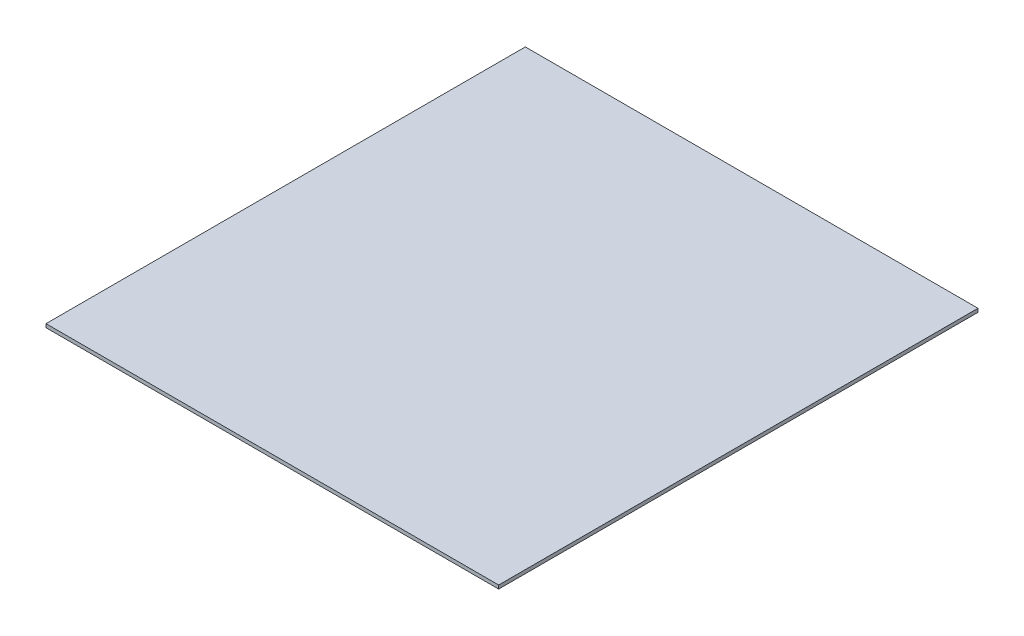
ISO-10303-21;
HEADER;
FILE_DESCRIPTION(('STEP AP214'),'2;1');
FILE_NAME('part.step','',(''),(''),'','','');
FILE_SCHEMA(('AUTOMOTIVE_DESIGN { 1 0 10303 214 1 1 1 1 }'));
ENDSEC;
DATA;
#1=APPLICATION_CONTEXT('core data for automotive mechanical design processes');
#2=APPLICATION_PROTOCOL_DEFINITION('international standard','automotive_design',2000,#1);
#3=PRODUCT_CONTEXT('',#1,'mechanical');
#4=PRODUCT('Part','Part','',(#3));
#5=PRODUCT_RELATED_PRODUCT_CATEGORY('part','',(#4));
#6=PRODUCT_DEFINITION_FORMATION('','',#4);
#7=PRODUCT_DEFINITION_CONTEXT('part definition',#1,'design');
#8=PRODUCT_DEFINITION('design','',#6,#7);
#9=PRODUCT_DEFINITION_SHAPE('','',#8);
#10=(LENGTH_UNIT() NAMED_UNIT(*) SI_UNIT(.MILLI.,.METRE.));
#11=(NAMED_UNIT(*) PLANE_ANGLE_UNIT() SI_UNIT($,.RADIAN.));
#12=(NAMED_UNIT(*) SI_UNIT($,.STERADIAN.) SOLID_ANGLE_UNIT());
#13=UNCERTAINTY_MEASURE_WITH_UNIT(LENGTH_MEASURE(1.E-05),#10,'distance_accuracy_value','');
#14=(GEOMETRIC_REPRESENTATION_CONTEXT(3) GLOBAL_UNCERTAINTY_ASSIGNED_CONTEXT((#13)) GLOBAL_UNIT_ASSIGNED_CONTEXT((#10,
#11,#12)) REPRESENTATION_CONTEXT('',''));
#15=CARTESIAN_POINT('',(0.,0.,0.));
#16=DIRECTION('',(0.,0.,1.));
#17=DIRECTION('',(1.,0.,0.));
#18=AXIS2_PLACEMENT_3D('',#15,#16,#17);
#19=CARTESIAN_POINT('',(255.,4.,-270.));
#20=DIRECTION('',(-1.,0.,0.));
#21=DIRECTION('',(0.,0.,1.));
#22=AXIS2_PLACEMENT_3D('',#19,#20,#21);
#23=PLANE('',#22);
#24=DIRECTION('',(0.,0.,-1.));
#25=VECTOR('',#24,1.);
#26=CARTESIAN_POINT('',(255.,0.,-270.));
#27=LINE('',#26,#25);
#28=CARTESIAN_POINT('',(255.,0.,270.));
#29=VERTEX_POINT('',#28);
#30=CARTESIAN_POINT('',(255.,0.,-270.));
#31=VERTEX_POINT('',#30);
#32=EDGE_CURVE('E107',#29,#31,#27,.T.);
#33=ORIENTED_EDGE('',*,*,#32,.T.);
#34=DIRECTION('',(0.,-1.,0.));
#35=VECTOR('',#34,1.);
#36=CARTESIAN_POINT('',(255.,4.,-270.));
#37=LINE('',#36,#35);
#38=CARTESIAN_POINT('',(255.,4.,-270.));
#39=VERTEX_POINT('',#38);
#40=EDGE_CURVE('E11',#39,#31,#37,.T.);
#41=ORIENTED_EDGE('',*,*,#40,.F.);
#42=DIRECTION('',(0.,0.,-1.));
#43=VECTOR('',#42,1.);
#44=CARTESIAN_POINT('',(255.,4.,-270.));
#45=LINE('',#44,#43);
#46=CARTESIAN_POINT('',(255.,4.,270.));
#47=VERTEX_POINT('',#46);
#48=EDGE_CURVE('E91',#47,#39,#45,.T.);
#49=ORIENTED_EDGE('',*,*,#48,.F.);
#50=DIRECTION('',(0.,-1.,0.));
#51=VECTOR('',#50,1.);
#52=CARTESIAN_POINT('',(255.,4.,270.));
#53=LINE('',#52,#51);
#54=EDGE_CURVE('E103',#47,#29,#53,.T.);
#55=ORIENTED_EDGE('',*,*,#54,.T.);
#56=EDGE_LOOP('',(#33,#41,#49,#55));
#57=FACE_BOUND('',#56,.T.);
#58=ADVANCED_FACE('F39',(#57),#23,.F.);
#59=CARTESIAN_POINT('',(-255.,4.,-270.));
#60=DIRECTION('',(0.,0.,1.));
#61=DIRECTION('',(1.,0.,0.));
#62=AXIS2_PLACEMENT_3D('',#59,#60,#61);
#63=PLANE('',#62);
#64=DIRECTION('',(-1.,0.,0.));
#65=VECTOR('',#64,1.);
#66=CARTESIAN_POINT('',(-255.,0.,-270.));
#67=LINE('',#66,#65);
#68=CARTESIAN_POINT('',(-255.,0.,-270.));
#69=VERTEX_POINT('',#68);
#70=EDGE_CURVE('E96',#31,#69,#67,.T.);
#71=ORIENTED_EDGE('',*,*,#70,.T.);
#72=DIRECTION('',(0.,-1.,0.));
#73=VECTOR('',#72,1.);
#74=CARTESIAN_POINT('',(-255.,4.,-270.));
#75=LINE('',#74,#73);
#76=CARTESIAN_POINT('',(-255.,4.,-270.));
#77=VERTEX_POINT('',#76);
#78=EDGE_CURVE('E48',#77,#69,#75,.T.);
#79=ORIENTED_EDGE('',*,*,#78,.F.);
#80=DIRECTION('',(-1.,0.,0.));
#81=VECTOR('',#80,1.);
#82=CARTESIAN_POINT('',(-255.,4.,-270.));
#83=LINE('',#82,#81);
#84=EDGE_CURVE('E86',#39,#77,#83,.T.);
#85=ORIENTED_EDGE('',*,*,#84,.F.);
#86=ORIENTED_EDGE('',*,*,#40,.T.);
#87=EDGE_LOOP('',(#71,#79,#85,#86));
#88=FACE_BOUND('',#87,.T.);
#89=ADVANCED_FACE('F95',(#88),#63,.F.);
#90=CARTESIAN_POINT('',(-255.,4.,-270.));
#91=DIRECTION('',(1.,0.,0.));
#92=DIRECTION('',(0.,0.,-1.));
#93=AXIS2_PLACEMENT_3D('',#90,#91,#92);
#94=PLANE('',#93);
#95=DIRECTION('',(0.,0.,1.));
#96=VECTOR('',#95,1.);
#97=CARTESIAN_POINT('',(-255.,0.,-270.));
#98=LINE('',#97,#96);
#99=CARTESIAN_POINT('',(-255.,0.,270.));
#100=VERTEX_POINT('',#99);
#101=EDGE_CURVE('E73',#69,#100,#98,.T.);
#102=ORIENTED_EDGE('',*,*,#101,.T.);
#103=DIRECTION('',(0.,-1.,0.));
#104=VECTOR('',#103,1.);
#105=CARTESIAN_POINT('',(-255.,4.,270.));
#106=LINE('',#105,#104);
#107=CARTESIAN_POINT('',(-255.,4.,270.));
#108=VERTEX_POINT('',#107);
#109=EDGE_CURVE('E98',#108,#100,#106,.T.);
#110=ORIENTED_EDGE('',*,*,#109,.F.);
#111=DIRECTION('',(0.,0.,1.));
#112=VECTOR('',#111,1.);
#113=CARTESIAN_POINT('',(-255.,4.,-270.));
#114=LINE('',#113,#112);
#115=EDGE_CURVE('E89',#77,#108,#114,.T.);
#116=ORIENTED_EDGE('',*,*,#115,.F.);
#117=ORIENTED_EDGE('',*,*,#78,.T.);
#118=EDGE_LOOP('',(#102,#110,#116,#117));
#119=FACE_BOUND('',#118,.T.);
#120=ADVANCED_FACE('F99',(#119),#94,.F.);
#121=CARTESIAN_POINT('',(-255.,4.,270.));
#122=DIRECTION('',(0.,0.,-1.));
#123=DIRECTION('',(-1.,0.,0.));
#124=AXIS2_PLACEMENT_3D('',#121,#122,#123);
#125=PLANE('',#124);
#126=DIRECTION('',(1.,0.,0.));
#127=VECTOR('',#126,1.);
#128=CARTESIAN_POINT('',(-255.,0.,270.));
#129=LINE('',#128,#127);
#130=EDGE_CURVE('E79',#100,#29,#129,.T.);
#131=ORIENTED_EDGE('',*,*,#130,.T.);
#132=ORIENTED_EDGE('',*,*,#54,.F.);
#133=DIRECTION('',(1.,0.,0.));
#134=VECTOR('',#133,1.);
#135=CARTESIAN_POINT('',(-255.,4.,270.));
#136=LINE('',#135,#134);
#137=EDGE_CURVE('E56',#108,#47,#136,.T.);
#138=ORIENTED_EDGE('',*,*,#137,.F.);
#139=ORIENTED_EDGE('',*,*,#109,.T.);
#140=EDGE_LOOP('',(#131,#132,#138,#139));
#141=FACE_BOUND('',#140,.T.);
#142=ADVANCED_FACE('F120',(#141),#125,.F.);
#143=CARTESIAN_POINT('',(0.,4.,0.));
#144=DIRECTION('',(0.,1.,0.));
#145=DIRECTION('',(0.,0.,1.));
#146=AXIS2_PLACEMENT_3D('',#143,#144,#145);
#147=PLANE('',#146);
#148=ORIENTED_EDGE('',*,*,#48,.T.);
#149=ORIENTED_EDGE('',*,*,#84,.T.);
#150=ORIENTED_EDGE('',*,*,#115,.T.);
#151=ORIENTED_EDGE('',*,*,#137,.T.);
#152=EDGE_LOOP('',(#148,#149,#150,#151));
#153=FACE_BOUND('',#152,.T.);
#154=ADVANCED_FACE('F87',(#153),#147,.T.);
#155=CARTESIAN_POINT('',(0.,0.,0.));
#156=DIRECTION('',(0.,1.,0.));
#157=DIRECTION('',(0.,0.,1.));
#158=AXIS2_PLACEMENT_3D('',#155,#156,#157);
#159=PLANE('',#158);
#160=ORIENTED_EDGE('',*,*,#32,.F.);
#161=ORIENTED_EDGE('',*,*,#130,.F.);
#162=ORIENTED_EDGE('',*,*,#101,.F.);
#163=ORIENTED_EDGE('',*,*,#70,.F.);
#164=EDGE_LOOP('',(#160,#161,#162,#163));
#165=FACE_BOUND('',#164,.T.);
#166=ADVANCED_FACE('F123',(#165),#159,.F.);
#167=CLOSED_SHELL('',(#58,#89,#120,#142,#154,#166));
#168=MANIFOLD_SOLID_BREP('B2',#167);
#169=ADVANCED_BREP_SHAPE_REPRESENTATION('',(#18,#168),#14);
#170=SHAPE_DEFINITION_REPRESENTATION(#9,#169);
ENDSEC;
END-ISO-10303-21;
